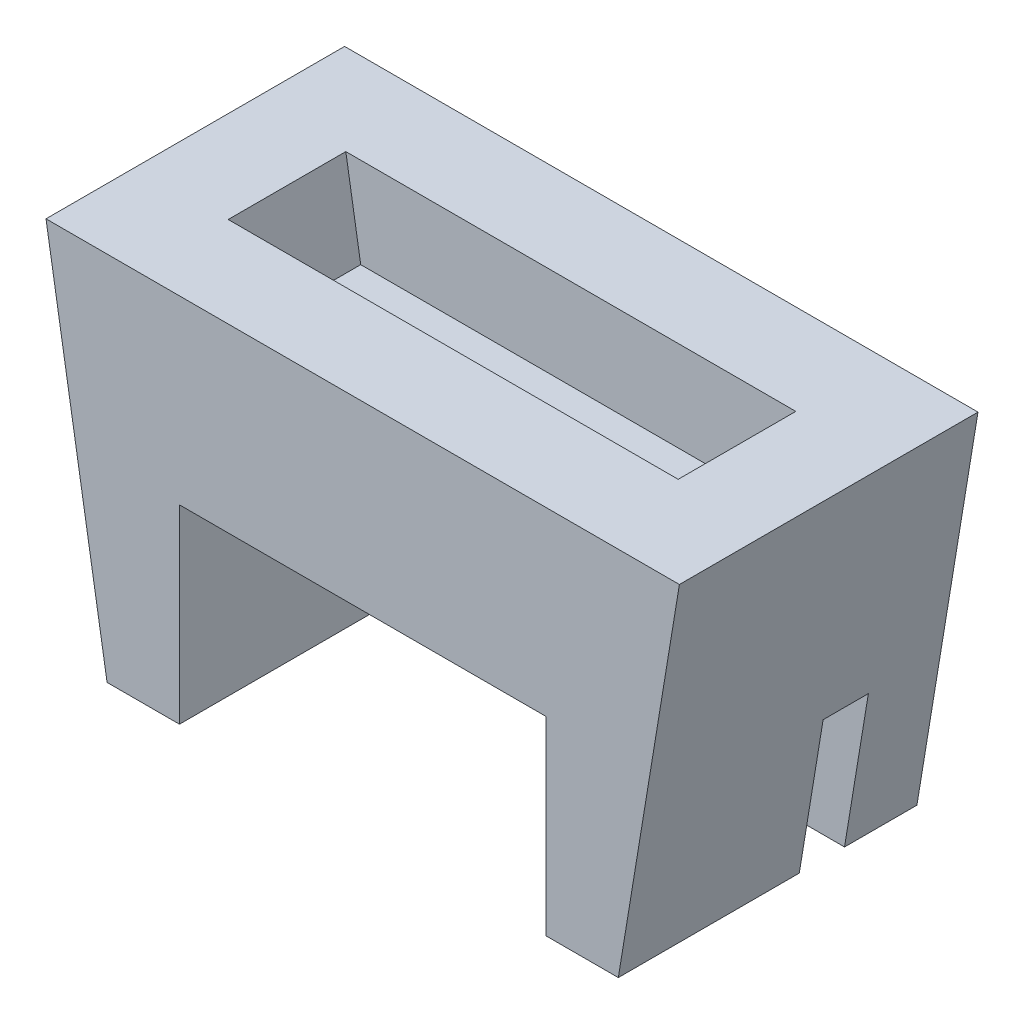
ISO-10303-21;
HEADER;
FILE_DESCRIPTION(('STEP AP214'),'2;1');
FILE_NAME('part.step','',(''),(''),'','','');
FILE_SCHEMA(('AUTOMOTIVE_DESIGN { 1 0 10303 214 1 1 1 1 }'));
ENDSEC;
DATA;
#1=APPLICATION_CONTEXT('core data for automotive mechanical design processes');
#2=APPLICATION_PROTOCOL_DEFINITION('international standard','automotive_design',2000,#1);
#3=PRODUCT_CONTEXT('',#1,'mechanical');
#4=PRODUCT('Part','Part','',(#3));
#5=PRODUCT_RELATED_PRODUCT_CATEGORY('part','',(#4));
#6=PRODUCT_DEFINITION_FORMATION('','',#4);
#7=PRODUCT_DEFINITION_CONTEXT('part definition',#1,'design');
#8=PRODUCT_DEFINITION('design','',#6,#7);
#9=PRODUCT_DEFINITION_SHAPE('','',#8);
#10=(LENGTH_UNIT() NAMED_UNIT(*) SI_UNIT(.MILLI.,.METRE.));
#11=(NAMED_UNIT(*) PLANE_ANGLE_UNIT() SI_UNIT($,.RADIAN.));
#12=(NAMED_UNIT(*) SI_UNIT($,.STERADIAN.) SOLID_ANGLE_UNIT());
#13=UNCERTAINTY_MEASURE_WITH_UNIT(LENGTH_MEASURE(1.E-05),#10,'distance_accuracy_value','');
#14=(GEOMETRIC_REPRESENTATION_CONTEXT(3) GLOBAL_UNCERTAINTY_ASSIGNED_CONTEXT((#13)) GLOBAL_UNIT_ASSIGNED_CONTEXT((#10,
#11,#12)) REPRESENTATION_CONTEXT('',''));
#15=CARTESIAN_POINT('',(0.,0.,0.));
#16=DIRECTION('',(0.,0.,1.));
#17=DIRECTION('',(1.,0.,0.));
#18=AXIS2_PLACEMENT_3D('',#15,#16,#17);
#19=CARTESIAN_POINT('',(20.25,-21.,30.));
#20=DIRECTION('',(0.,1.,0.));
#21=DIRECTION('',(-1.,0.,0.));
#22=AXIS2_PLACEMENT_3D('',#19,#20,#21);
#23=PLANE('',#22);
#24=DIRECTION('',(0.,0.,-1.));
#25=VECTOR('',#24,1.);
#26=CARTESIAN_POINT('',(28.25,-21.,30.));
#27=LINE('',#26,#25);
#28=CARTESIAN_POINT('',(28.25,-21.,5.));
#29=VERTEX_POINT('',#28);
#30=CARTESIAN_POINT('',(28.25,-21.,-3.));
#31=VERTEX_POINT('',#30);
#32=EDGE_CURVE('E298',#29,#31,#27,.T.);
#33=ORIENTED_EDGE('',*,*,#32,.F.);
#34=DIRECTION('',(-1.,0.,0.));
#35=VECTOR('',#34,1.);
#36=CARTESIAN_POINT('',(20.25,-21.,5.));
#37=LINE('',#36,#35);
#38=CARTESIAN_POINT('',(20.25,-21.,5.));
#39=VERTEX_POINT('',#38);
#40=EDGE_CURVE('E190',#29,#39,#37,.T.);
#41=ORIENTED_EDGE('',*,*,#40,.T.);
#42=DIRECTION('',(0.,0.,-1.));
#43=VECTOR('',#42,1.);
#44=CARTESIAN_POINT('',(20.25,-21.,30.));
#45=LINE('',#44,#43);
#46=CARTESIAN_POINT('',(20.25,-21.,0.));
#47=VERTEX_POINT('',#46);
#48=EDGE_CURVE('E303',#39,#47,#45,.T.);
#49=ORIENTED_EDGE('',*,*,#48,.T.);
#50=DIRECTION('',(-1.,0.,0.));
#51=VECTOR('',#50,1.);
#52=CARTESIAN_POINT('',(-28.25,-21.,0.));
#53=LINE('',#52,#51);
#54=CARTESIAN_POINT('',(-20.25,-21.,0.));
#55=VERTEX_POINT('',#54);
#56=EDGE_CURVE('E235',#47,#55,#53,.T.);
#57=ORIENTED_EDGE('',*,*,#56,.T.);
#58=DIRECTION('',(0.,0.,-1.));
#59=VECTOR('',#58,1.);
#60=CARTESIAN_POINT('',(-20.25,-21.,30.));
#61=LINE('',#60,#59);
#62=CARTESIAN_POINT('',(-20.25,-21.,30.));
#63=VERTEX_POINT('',#62);
#64=EDGE_CURVE('E315',#63,#55,#61,.T.);
#65=ORIENTED_EDGE('',*,*,#64,.F.);
#66=DIRECTION('',(1.,0.,0.));
#67=VECTOR('',#66,1.);
#68=CARTESIAN_POINT('',(-28.25,-21.,30.));
#69=LINE('',#68,#67);
#70=CARTESIAN_POINT('',(-28.25,-21.,30.));
#71=VERTEX_POINT('',#70);
#72=EDGE_CURVE('E260',#71,#63,#69,.T.);
#73=ORIENTED_EDGE('',*,*,#72,.F.);
#74=DIRECTION('',(0.,0.,-1.));
#75=VECTOR('',#74,1.);
#76=CARTESIAN_POINT('',(-28.25,-21.,30.));
#77=LINE('',#76,#75);
#78=CARTESIAN_POINT('',(-28.25,-21.,-3.));
#79=VERTEX_POINT('',#78);
#80=EDGE_CURVE('E319',#71,#79,#77,.T.);
#81=ORIENTED_EDGE('',*,*,#80,.T.);
#82=DIRECTION('',(-1.,0.,0.));
#83=VECTOR('',#82,1.);
#84=CARTESIAN_POINT('',(-28.25,-21.,-3.));
#85=LINE('',#84,#83);
#86=EDGE_CURVE('E240',#31,#79,#85,.T.);
#87=ORIENTED_EDGE('',*,*,#86,.F.);
#88=EDGE_LOOP('',(#33,#41,#49,#57,#65,#73,#81,#87));
#89=FACE_BOUND('',#88,.T.);
#90=ADVANCED_FACE('F43',(#89),#23,.F.);
#91=CARTESIAN_POINT('',(-35.,20.,30.));
#92=DIRECTION('',(0.,-1.,0.));
#93=DIRECTION('',(0.,0.,-1.));
#94=AXIS2_PLACEMENT_3D('',#91,#92,#93);
#95=PLANE('',#94);
#96=DIRECTION('',(0.,0.,-1.));
#97=VECTOR('',#96,1.);
#98=CARTESIAN_POINT('',(35.,20.,30.));
#99=LINE('',#98,#97);
#100=CARTESIAN_POINT('',(35.,20.,30.));
#101=VERTEX_POINT('',#100);
#102=CARTESIAN_POINT('',(35.,20.,-3.));
#103=VERTEX_POINT('',#102);
#104=EDGE_CURVE('E295',#101,#103,#99,.T.);
#105=ORIENTED_EDGE('',*,*,#104,.T.);
#106=DIRECTION('',(1.,0.,0.));
#107=VECTOR('',#106,1.);
#108=CARTESIAN_POINT('',(35.,20.,-3.));
#109=LINE('',#108,#107);
#110=CARTESIAN_POINT('',(-35.,20.,-3.));
#111=VERTEX_POINT('',#110);
#112=EDGE_CURVE('E248',#111,#103,#109,.T.);
#113=ORIENTED_EDGE('',*,*,#112,.F.);
#114=DIRECTION('',(0.,0.,-1.));
#115=VECTOR('',#114,1.);
#116=CARTESIAN_POINT('',(-35.,20.,30.));
#117=LINE('',#116,#115);
#118=CARTESIAN_POINT('',(-35.,20.,30.));
#119=VERTEX_POINT('',#118);
#120=EDGE_CURVE('E282',#119,#111,#117,.T.);
#121=ORIENTED_EDGE('',*,*,#120,.F.);
#122=DIRECTION('',(-1.,0.,0.));
#123=VECTOR('',#122,1.);
#124=CARTESIAN_POINT('',(-35.,20.,30.));
#125=LINE('',#124,#123);
#126=EDGE_CURVE('E279',#101,#119,#125,.T.);
#127=ORIENTED_EDGE('',*,*,#126,.F.);
#128=EDGE_LOOP('',(#105,#113,#121,#127));
#129=FACE_BOUND('',#128,.T.);
#130=DIRECTION('',(0.,0.,-1.));
#131=VECTOR('',#130,1.);
#132=CARTESIAN_POINT('',(24.8653840618325,20.,30.));
#133=LINE('',#132,#131);
#134=CARTESIAN_POINT('',(24.8653840618325,20.,20.));
#135=VERTEX_POINT('',#134);
#136=CARTESIAN_POINT('',(24.8653840618325,20.,7.));
#137=VERTEX_POINT('',#136);
#138=EDGE_CURVE('E216',#135,#137,#133,.T.);
#139=ORIENTED_EDGE('',*,*,#138,.F.);
#140=DIRECTION('',(-1.,0.,0.));
#141=VECTOR('',#140,1.);
#142=CARTESIAN_POINT('',(-35.,20.,20.));
#143=LINE('',#142,#141);
#144=CARTESIAN_POINT('',(-24.8653840618325,20.,20.));
#145=VERTEX_POINT('',#144);
#146=EDGE_CURVE('E208',#135,#145,#143,.T.);
#147=ORIENTED_EDGE('',*,*,#146,.T.);
#148=DIRECTION('',(0.,0.,-1.));
#149=VECTOR('',#148,1.);
#150=CARTESIAN_POINT('',(-24.8653840618325,20.,30.));
#151=LINE('',#150,#149);
#152=CARTESIAN_POINT('',(-24.8653840618325,20.,7.));
#153=VERTEX_POINT('',#152);
#154=EDGE_CURVE('E212',#145,#153,#151,.T.);
#155=ORIENTED_EDGE('',*,*,#154,.T.);
#156=DIRECTION('',(1.,0.,0.));
#157=VECTOR('',#156,1.);
#158=CARTESIAN_POINT('',(0.,20.,7.));
#159=LINE('',#158,#157);
#160=EDGE_CURVE('E198',#153,#137,#159,.T.);
#161=ORIENTED_EDGE('',*,*,#160,.T.);
#162=EDGE_LOOP('',(#139,#147,#155,#161));
#163=FACE_BOUND('',#162,.T.);
#164=ADVANCED_FACE('F361',(#129,#163),#95,.F.);
#165=CARTESIAN_POINT('',(-35.,20.,30.));
#166=DIRECTION('',(0.986717213657746,0.162447346150971,0.));
#167=DIRECTION('',(-0.162447346150971,0.986717213657746,0.));
#168=AXIS2_PLACEMENT_3D('',#165,#166,#167);
#169=PLANE('',#168);
#170=ORIENTED_EDGE('',*,*,#120,.T.);
#171=DIRECTION('',(-0.162447346150971,0.986717213657746,0.));
#172=VECTOR('',#171,1.);
#173=CARTESIAN_POINT('',(-35.,20.,-3.));
#174=LINE('',#173,#172);
#175=EDGE_CURVE('E244',#79,#111,#174,.T.);
#176=ORIENTED_EDGE('',*,*,#175,.F.);
#177=ORIENTED_EDGE('',*,*,#80,.F.);
#178=DIRECTION('',(0.162447346150971,-0.986717213657746,0.));
#179=VECTOR('',#178,1.);
#180=CARTESIAN_POINT('',(-35.,20.,30.));
#181=LINE('',#180,#179);
#182=EDGE_CURVE('E256',#119,#71,#181,.T.);
#183=ORIENTED_EDGE('',*,*,#182,.F.);
#184=EDGE_LOOP('',(#170,#176,#177,#183));
#185=FACE_BOUND('',#184,.T.);
#186=ADVANCED_FACE('F45',(#185),#169,.F.);
#187=CARTESIAN_POINT('',(-20.25,-21.,30.));
#188=DIRECTION('',(-1.,0.,0.));
#189=DIRECTION('',(0.,0.,1.));
#190=AXIS2_PLACEMENT_3D('',#187,#188,#189);
#191=PLANE('',#190);
#192=DIRECTION('',(0.,1.,0.));
#193=VECTOR('',#192,1.);
#194=CARTESIAN_POINT('',(-20.25,-21.,0.));
#195=LINE('',#194,#193);
#196=CARTESIAN_POINT('',(-20.25,0.,0.));
#197=VERTEX_POINT('',#196);
#198=EDGE_CURVE('E252',#55,#197,#195,.T.);
#199=ORIENTED_EDGE('',*,*,#198,.T.);
#200=DIRECTION('',(0.,0.,-1.));
#201=VECTOR('',#200,1.);
#202=CARTESIAN_POINT('',(-20.25,0.,30.));
#203=LINE('',#202,#201);
#204=CARTESIAN_POINT('',(-20.25,0.,30.));
#205=VERTEX_POINT('',#204);
#206=EDGE_CURVE('E311',#205,#197,#203,.T.);
#207=ORIENTED_EDGE('',*,*,#206,.F.);
#208=DIRECTION('',(0.,1.,0.));
#209=VECTOR('',#208,1.);
#210=CARTESIAN_POINT('',(-20.25,-21.,30.));
#211=LINE('',#210,#209);
#212=EDGE_CURVE('E264',#63,#205,#211,.T.);
#213=ORIENTED_EDGE('',*,*,#212,.F.);
#214=ORIENTED_EDGE('',*,*,#64,.T.);
#215=EDGE_LOOP('',(#199,#207,#213,#214));
#216=FACE_BOUND('',#215,.T.);
#217=ADVANCED_FACE('F346',(#216),#191,.F.);
#218=CARTESIAN_POINT('',(-20.25,0.,30.));
#219=DIRECTION('',(0.,1.,0.));
#220=DIRECTION('',(-1.,0.,0.));
#221=AXIS2_PLACEMENT_3D('',#218,#219,#220);
#222=PLANE('',#221);
#223=DIRECTION('',(1.,0.,0.));
#224=VECTOR('',#223,1.);
#225=CARTESIAN_POINT('',(-20.25,0.,0.));
#226=LINE('',#225,#224);
#227=CARTESIAN_POINT('',(20.25,0.,0.));
#228=VERTEX_POINT('',#227);
#229=EDGE_CURVE('E286',#197,#228,#226,.T.);
#230=ORIENTED_EDGE('',*,*,#229,.T.);
#231=DIRECTION('',(0.,0.,-1.));
#232=VECTOR('',#231,1.);
#233=CARTESIAN_POINT('',(20.25,0.,30.));
#234=LINE('',#233,#232);
#235=CARTESIAN_POINT('',(20.25,0.,30.));
#236=VERTEX_POINT('',#235);
#237=EDGE_CURVE('E307',#236,#228,#234,.T.);
#238=ORIENTED_EDGE('',*,*,#237,.F.);
#239=DIRECTION('',(1.,0.,0.));
#240=VECTOR('',#239,1.);
#241=CARTESIAN_POINT('',(-20.25,0.,30.));
#242=LINE('',#241,#240);
#243=EDGE_CURVE('E267',#205,#236,#242,.T.);
#244=ORIENTED_EDGE('',*,*,#243,.F.);
#245=ORIENTED_EDGE('',*,*,#206,.T.);
#246=EDGE_LOOP('',(#230,#238,#244,#245));
#247=FACE_BOUND('',#246,.T.);
#248=ADVANCED_FACE('F341',(#247),#222,.F.);
#249=CARTESIAN_POINT('',(20.25,0.,30.));
#250=DIRECTION('',(1.,0.,0.));
#251=DIRECTION('',(0.,1.,0.));
#252=AXIS2_PLACEMENT_3D('',#249,#250,#251);
#253=PLANE('',#252);
#254=ORIENTED_EDGE('',*,*,#48,.F.);
#255=DIRECTION('',(0.,-1.,0.));
#256=VECTOR('',#255,1.);
#257=CARTESIAN_POINT('',(20.25,-25.,5.));
#258=LINE('',#257,#256);
#259=CARTESIAN_POINT('',(20.25,-4.99999999999999,5.));
#260=VERTEX_POINT('',#259);
#261=EDGE_CURVE('E167',#260,#39,#258,.T.);
#262=ORIENTED_EDGE('',*,*,#261,.F.);
#263=DIRECTION('',(0.,0.,-1.));
#264=VECTOR('',#263,1.);
#265=CARTESIAN_POINT('',(20.25,-4.99999999999999,5.));
#266=LINE('',#265,#264);
#267=CARTESIAN_POINT('',(20.25,-4.99999999999999,10.));
#268=VERTEX_POINT('',#267);
#269=EDGE_CURVE('E161',#268,#260,#266,.T.);
#270=ORIENTED_EDGE('',*,*,#269,.F.);
#271=DIRECTION('',(0.,1.,0.));
#272=VECTOR('',#271,1.);
#273=CARTESIAN_POINT('',(20.25,-4.99999999999999,10.));
#274=LINE('',#273,#272);
#275=CARTESIAN_POINT('',(20.25,-21.,10.));
#276=VERTEX_POINT('',#275);
#277=EDGE_CURVE('E170',#276,#268,#274,.T.);
#278=ORIENTED_EDGE('',*,*,#277,.F.);
#279=CARTESIAN_POINT('',(20.25,-21.,30.));
#280=VERTEX_POINT('',#279);
#281=EDGE_CURVE('E304',#280,#276,#45,.T.);
#282=ORIENTED_EDGE('',*,*,#281,.F.);
#283=DIRECTION('',(0.,-1.,0.));
#284=VECTOR('',#283,1.);
#285=CARTESIAN_POINT('',(20.25,0.,30.));
#286=LINE('',#285,#284);
#287=EDGE_CURVE('E270',#236,#280,#286,.T.);
#288=ORIENTED_EDGE('',*,*,#287,.F.);
#289=ORIENTED_EDGE('',*,*,#237,.T.);
#290=DIRECTION('',(0.,-1.,0.));
#291=VECTOR('',#290,1.);
#292=CARTESIAN_POINT('',(20.25,0.,0.));
#293=LINE('',#292,#291);
#294=EDGE_CURVE('E261',#228,#47,#293,.T.);
#295=ORIENTED_EDGE('',*,*,#294,.T.);
#296=EDGE_LOOP('',(#254,#262,#270,#278,#282,#288,#289,#295));
#297=FACE_BOUND('',#296,.T.);
#298=ADVANCED_FACE('F180',(#297),#253,.F.);
#299=ORIENTED_EDGE('',*,*,#281,.T.);
#300=DIRECTION('',(1.,0.,0.));
#301=VECTOR('',#300,1.);
#302=CARTESIAN_POINT('',(20.25,-21.,10.));
#303=LINE('',#302,#301);
#304=CARTESIAN_POINT('',(28.25,-21.,10.));
#305=VERTEX_POINT('',#304);
#306=EDGE_CURVE('E173',#276,#305,#303,.T.);
#307=ORIENTED_EDGE('',*,*,#306,.T.);
#308=CARTESIAN_POINT('',(28.25,-21.,30.));
#309=VERTEX_POINT('',#308);
#310=EDGE_CURVE('E299',#309,#305,#27,.T.);
#311=ORIENTED_EDGE('',*,*,#310,.F.);
#312=DIRECTION('',(1.,0.,0.));
#313=VECTOR('',#312,1.);
#314=CARTESIAN_POINT('',(20.25,-21.,30.));
#315=LINE('',#314,#313);
#316=EDGE_CURVE('E273',#280,#309,#315,.T.);
#317=ORIENTED_EDGE('',*,*,#316,.F.);
#318=EDGE_LOOP('',(#299,#307,#311,#317));
#319=FACE_BOUND('',#318,.T.);
#320=ADVANCED_FACE('F331',(#319),#23,.F.);
#321=CARTESIAN_POINT('',(28.25,-21.,30.));
#322=DIRECTION('',(-0.986717213657746,0.16244734615097,0.));
#323=DIRECTION('',(-0.16244734615097,-0.986717213657746,0.));
#324=AXIS2_PLACEMENT_3D('',#321,#322,#323);
#325=PLANE('',#324);
#326=DIRECTION('',(0.,0.,-1.));
#327=VECTOR('',#326,1.);
#328=CARTESIAN_POINT('',(30.8841463414634,-4.99999999999999,30.));
#329=LINE('',#328,#327);
#330=CARTESIAN_POINT('',(30.8841463414634,-4.99999999999999,10.));
#331=VERTEX_POINT('',#330);
#332=CARTESIAN_POINT('',(30.8841463414634,-4.99999999999999,5.));
#333=VERTEX_POINT('',#332);
#334=EDGE_CURVE('E52',#331,#333,#329,.T.);
#335=ORIENTED_EDGE('',*,*,#334,.T.);
#336=DIRECTION('',(-0.16244734615097,-0.986717213657746,0.));
#337=VECTOR('',#336,1.);
#338=CARTESIAN_POINT('',(28.25,-21.,5.));
#339=LINE('',#338,#337);
#340=EDGE_CURVE('E11',#333,#29,#339,.T.);
#341=ORIENTED_EDGE('',*,*,#340,.T.);
#342=ORIENTED_EDGE('',*,*,#32,.T.);
#343=DIRECTION('',(-0.16244734615097,-0.986717213657746,0.));
#344=VECTOR('',#343,1.);
#345=CARTESIAN_POINT('',(28.25,-21.,-3.));
#346=LINE('',#345,#344);
#347=EDGE_CURVE('E236',#103,#31,#346,.T.);
#348=ORIENTED_EDGE('',*,*,#347,.F.);
#349=ORIENTED_EDGE('',*,*,#104,.F.);
#350=DIRECTION('',(0.16244734615097,0.986717213657746,0.));
#351=VECTOR('',#350,1.);
#352=CARTESIAN_POINT('',(28.25,-21.,30.));
#353=LINE('',#352,#351);
#354=EDGE_CURVE('E276',#309,#101,#353,.T.);
#355=ORIENTED_EDGE('',*,*,#354,.F.);
#356=ORIENTED_EDGE('',*,*,#310,.T.);
#357=DIRECTION('',(0.16244734615097,0.986717213657746,0.));
#358=VECTOR('',#357,1.);
#359=CARTESIAN_POINT('',(28.25,-21.,10.));
#360=LINE('',#359,#358);
#361=EDGE_CURVE('E322',#305,#331,#360,.T.);
#362=ORIENTED_EDGE('',*,*,#361,.T.);
#363=EDGE_LOOP('',(#335,#341,#342,#348,#349,#355,#356,#362));
#364=FACE_BOUND('',#363,.T.);
#365=ADVANCED_FACE('F326',(#364),#325,.F.);
#366=CARTESIAN_POINT('',(0.,0.,30.));
#367=DIRECTION('',(0.,0.,1.));
#368=DIRECTION('',(1.,0.,0.));
#369=AXIS2_PLACEMENT_3D('',#366,#367,#368);
#370=PLANE('',#369);
#371=ORIENTED_EDGE('',*,*,#182,.T.);
#372=ORIENTED_EDGE('',*,*,#72,.T.);
#373=ORIENTED_EDGE('',*,*,#212,.T.);
#374=ORIENTED_EDGE('',*,*,#243,.T.);
#375=ORIENTED_EDGE('',*,*,#287,.T.);
#376=ORIENTED_EDGE('',*,*,#316,.T.);
#377=ORIENTED_EDGE('',*,*,#354,.T.);
#378=ORIENTED_EDGE('',*,*,#126,.T.);
#379=EDGE_LOOP('',(#371,#372,#373,#374,#375,#376,#377,#378));
#380=FACE_BOUND('',#379,.T.);
#381=ADVANCED_FACE('F336',(#380),#370,.T.);
#382=CARTESIAN_POINT('',(0.,0.,0.));
#383=DIRECTION('',(0.,0.,1.));
#384=DIRECTION('',(1.,0.,0.));
#385=AXIS2_PLACEMENT_3D('',#382,#383,#384);
#386=PLANE('',#385);
#387=ORIENTED_EDGE('',*,*,#294,.F.);
#388=ORIENTED_EDGE('',*,*,#229,.F.);
#389=ORIENTED_EDGE('',*,*,#198,.F.);
#390=ORIENTED_EDGE('',*,*,#56,.F.);
#391=EDGE_LOOP('',(#387,#388,#389,#390));
#392=FACE_BOUND('',#391,.T.);
#393=ADVANCED_FACE('F343',(#392),#386,.T.);
#394=CARTESIAN_POINT('',(0.,0.,-3.));
#395=DIRECTION('',(0.,0.,1.));
#396=DIRECTION('',(1.,0.,0.));
#397=AXIS2_PLACEMENT_3D('',#394,#395,#396);
#398=PLANE('',#397);
#399=ORIENTED_EDGE('',*,*,#347,.T.);
#400=ORIENTED_EDGE('',*,*,#86,.T.);
#401=ORIENTED_EDGE('',*,*,#175,.T.);
#402=ORIENTED_EDGE('',*,*,#112,.T.);
#403=EDGE_LOOP('',(#399,#400,#401,#402));
#404=FACE_BOUND('',#403,.T.);
#405=ADVANCED_FACE('F357',(#404),#398,.F.);
#406=CARTESIAN_POINT('',(-25.1328278634225,21.6244734615097,30.));
#407=DIRECTION('',(0.986717213657746,0.162447346150971,0.));
#408=DIRECTION('',(-0.162447346150971,0.986717213657746,0.));
#409=AXIS2_PLACEMENT_3D('',#406,#407,#408);
#410=PLANE('',#409);
#411=DIRECTION('',(0.,0.,-1.));
#412=VECTOR('',#411,1.);
#413=CARTESIAN_POINT('',(-23.2190425984179,10.,30.));
#414=LINE('',#413,#412);
#415=CARTESIAN_POINT('',(-23.2190425984179,10.,20.));
#416=VERTEX_POINT('',#415);
#417=CARTESIAN_POINT('',(-23.2190425984179,10.,7.));
#418=VERTEX_POINT('',#417);
#419=EDGE_CURVE('E222',#416,#418,#414,.T.);
#420=ORIENTED_EDGE('',*,*,#419,.T.);
#421=DIRECTION('',(-0.162447346150971,0.986717213657746,0.));
#422=VECTOR('',#421,1.);
#423=CARTESIAN_POINT('',(-21.0034160987167,-3.45787947966677,7.));
#424=LINE('',#423,#422);
#425=EDGE_CURVE('E195',#418,#153,#424,.T.);
#426=ORIENTED_EDGE('',*,*,#425,.T.);
#427=ORIENTED_EDGE('',*,*,#154,.F.);
#428=DIRECTION('',(0.162447346150971,-0.986717213657746,0.));
#429=VECTOR('',#428,1.);
#430=CARTESIAN_POINT('',(-25.1328278634225,21.6244734615097,20.));
#431=LINE('',#430,#429);
#432=EDGE_CURVE('E67',#145,#416,#431,.T.);
#433=ORIENTED_EDGE('',*,*,#432,.T.);
#434=EDGE_LOOP('',(#420,#426,#427,#433));
#435=FACE_BOUND('',#434,.T.);
#436=ADVANCED_FACE('F427',(#435),#410,.T.);
#437=CARTESIAN_POINT('',(-20.25,10.,30.));
#438=DIRECTION('',(0.,1.,0.));
#439=DIRECTION('',(-1.,0.,0.));
#440=AXIS2_PLACEMENT_3D('',#437,#438,#439);
#441=PLANE('',#440);
#442=ORIENTED_EDGE('',*,*,#419,.F.);
#443=DIRECTION('',(1.,0.,0.));
#444=VECTOR('',#443,1.);
#445=CARTESIAN_POINT('',(-20.25,10.,20.));
#446=LINE('',#445,#444);
#447=CARTESIAN_POINT('',(23.2190425984179,10.,20.));
#448=VERTEX_POINT('',#447);
#449=EDGE_CURVE('E201',#416,#448,#446,.T.);
#450=ORIENTED_EDGE('',*,*,#449,.T.);
#451=DIRECTION('',(0.,0.,-1.));
#452=VECTOR('',#451,1.);
#453=CARTESIAN_POINT('',(23.2190425984179,10.,30.));
#454=LINE('',#453,#452);
#455=CARTESIAN_POINT('',(23.2190425984179,10.,7.));
#456=VERTEX_POINT('',#455);
#457=EDGE_CURVE('E228',#448,#456,#454,.T.);
#458=ORIENTED_EDGE('',*,*,#457,.T.);
#459=DIRECTION('',(1.,0.,0.));
#460=VECTOR('',#459,1.);
#461=CARTESIAN_POINT('',(-20.25,10.,7.));
#462=LINE('',#461,#460);
#463=EDGE_CURVE('E231',#418,#456,#462,.T.);
#464=ORIENTED_EDGE('',*,*,#463,.F.);
#465=EDGE_LOOP('',(#442,#450,#458,#464));
#466=FACE_BOUND('',#465,.T.);
#467=ADVANCED_FACE('F435',(#466),#441,.T.);
#468=CARTESIAN_POINT('',(18.3828278634225,-19.3755265384903,30.));
#469=DIRECTION('',(-0.986717213657746,0.16244734615097,0.));
#470=DIRECTION('',(-0.16244734615097,-0.986717213657746,0.));
#471=AXIS2_PLACEMENT_3D('',#468,#469,#470);
#472=PLANE('',#471);
#473=DIRECTION('',(0.16244734615097,0.986717213657746,0.));
#474=VECTOR('',#473,1.);
#475=CARTESIAN_POINT('',(18.3828278634225,-19.3755265384903,20.));
#476=LINE('',#475,#474);
#477=EDGE_CURVE('E205',#448,#135,#476,.T.);
#478=ORIENTED_EDGE('',*,*,#477,.T.);
#479=ORIENTED_EDGE('',*,*,#138,.T.);
#480=DIRECTION('',(-0.16244734615097,-0.986717213657746,0.));
#481=VECTOR('',#480,1.);
#482=CARTESIAN_POINT('',(21.0034160987167,-3.45787947966677,7.));
#483=LINE('',#482,#481);
#484=EDGE_CURVE('E194',#137,#456,#483,.T.);
#485=ORIENTED_EDGE('',*,*,#484,.T.);
#486=ORIENTED_EDGE('',*,*,#457,.F.);
#487=EDGE_LOOP('',(#478,#479,#485,#486));
#488=FACE_BOUND('',#487,.T.);
#489=ADVANCED_FACE('F443',(#488),#472,.T.);
#490=CARTESIAN_POINT('',(0.,0.,20.));
#491=DIRECTION('',(0.,0.,1.));
#492=DIRECTION('',(1.,0.,0.));
#493=AXIS2_PLACEMENT_3D('',#490,#491,#492);
#494=PLANE('',#493);
#495=ORIENTED_EDGE('',*,*,#432,.F.);
#496=ORIENTED_EDGE('',*,*,#146,.F.);
#497=ORIENTED_EDGE('',*,*,#477,.F.);
#498=ORIENTED_EDGE('',*,*,#449,.F.);
#499=EDGE_LOOP('',(#495,#496,#497,#498));
#500=FACE_BOUND('',#499,.T.);
#501=ADVANCED_FACE('F451',(#500),#494,.F.);
#502=CARTESIAN_POINT('',(0.,0.,7.));
#503=DIRECTION('',(0.,0.,1.));
#504=DIRECTION('',(1.,0.,0.));
#505=AXIS2_PLACEMENT_3D('',#502,#503,#504);
#506=PLANE('',#505);
#507=ORIENTED_EDGE('',*,*,#463,.T.);
#508=ORIENTED_EDGE('',*,*,#484,.F.);
#509=ORIENTED_EDGE('',*,*,#160,.F.);
#510=ORIENTED_EDGE('',*,*,#425,.F.);
#511=EDGE_LOOP('',(#507,#508,#509,#510));
#512=FACE_BOUND('',#511,.T.);
#513=ADVANCED_FACE('F459',(#512),#506,.T.);
#514=CARTESIAN_POINT('',(35.,-25.,5.));
#515=DIRECTION('',(0.,0.,-1.));
#516=DIRECTION('',(-1.,0.,0.));
#517=AXIS2_PLACEMENT_3D('',#514,#515,#516);
#518=PLANE('',#517);
#519=ORIENTED_EDGE('',*,*,#340,.F.);
#520=DIRECTION('',(-1.,0.,0.));
#521=VECTOR('',#520,1.);
#522=CARTESIAN_POINT('',(35.,-4.99999999999999,5.));
#523=LINE('',#522,#521);
#524=EDGE_CURVE('E166',#333,#260,#523,.T.);
#525=ORIENTED_EDGE('',*,*,#524,.T.);
#526=ORIENTED_EDGE('',*,*,#261,.T.);
#527=ORIENTED_EDGE('',*,*,#40,.F.);
#528=EDGE_LOOP('',(#519,#525,#526,#527));
#529=FACE_BOUND('',#528,.T.);
#530=ADVANCED_FACE('F466',(#529),#518,.F.);
#531=CARTESIAN_POINT('',(35.,-4.99999999999999,5.));
#532=DIRECTION('',(0.,1.,0.));
#533=DIRECTION('',(-1.,0.,0.));
#534=AXIS2_PLACEMENT_3D('',#531,#532,#533);
#535=PLANE('',#534);
#536=DIRECTION('',(-1.,0.,0.));
#537=VECTOR('',#536,1.);
#538=CARTESIAN_POINT('',(35.,-4.99999999999999,10.));
#539=LINE('',#538,#537);
#540=EDGE_CURVE('E59',#331,#268,#539,.T.);
#541=ORIENTED_EDGE('',*,*,#540,.T.);
#542=ORIENTED_EDGE('',*,*,#269,.T.);
#543=ORIENTED_EDGE('',*,*,#524,.F.);
#544=ORIENTED_EDGE('',*,*,#334,.F.);
#545=EDGE_LOOP('',(#541,#542,#543,#544));
#546=FACE_BOUND('',#545,.T.);
#547=ADVANCED_FACE('F158',(#546),#535,.F.);
#548=CARTESIAN_POINT('',(35.,-4.99999999999999,10.));
#549=DIRECTION('',(0.,0.,1.));
#550=DIRECTION('',(1.,0.,0.));
#551=AXIS2_PLACEMENT_3D('',#548,#549,#550);
#552=PLANE('',#551);
#553=ORIENTED_EDGE('',*,*,#277,.T.);
#554=ORIENTED_EDGE('',*,*,#540,.F.);
#555=ORIENTED_EDGE('',*,*,#361,.F.);
#556=ORIENTED_EDGE('',*,*,#306,.F.);
#557=EDGE_LOOP('',(#553,#554,#555,#556));
#558=FACE_BOUND('',#557,.T.);
#559=ADVANCED_FACE('F171',(#558),#552,.F.);
#560=CLOSED_SHELL('',(#90,#164,#186,#217,#248,#298,#320,#365,#381,#393,#405,#436,#467,#489,#501,
#513,#530,#547,#559));
#561=MANIFOLD_SOLID_BREP('B2',#560);
#562=ADVANCED_BREP_SHAPE_REPRESENTATION('',(#18,#561),#14);
#563=SHAPE_DEFINITION_REPRESENTATION(#9,#562);
ENDSEC;
END-ISO-10303-21;
